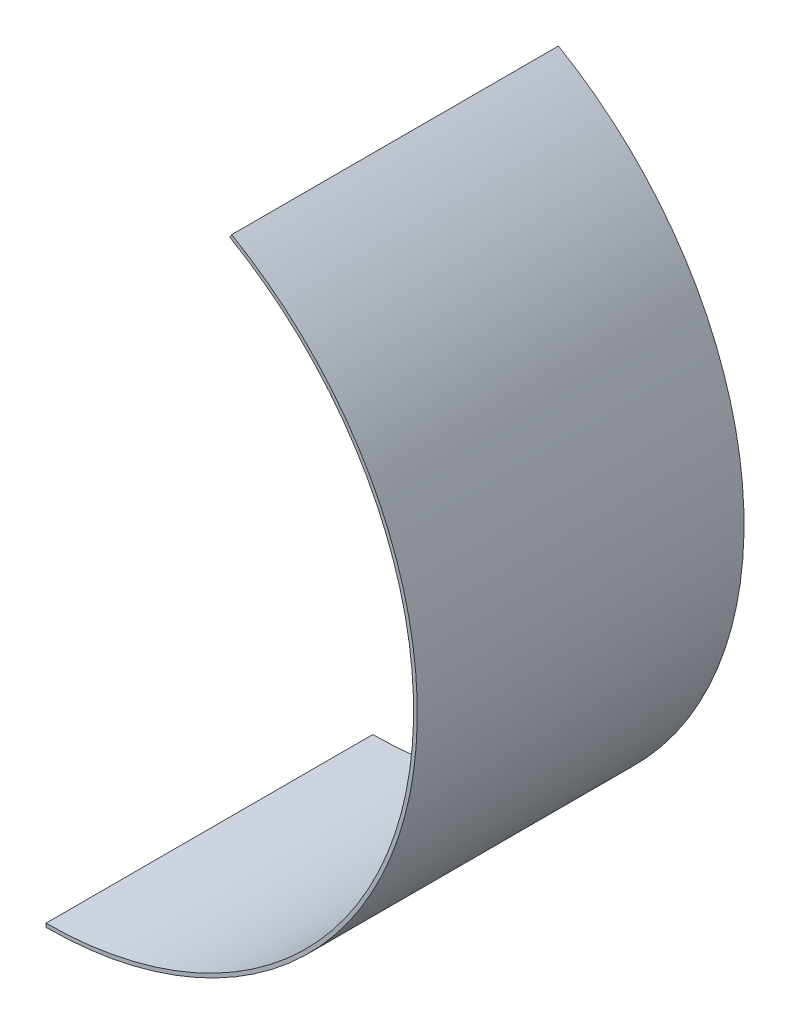
ISO-10303-21;
HEADER;
FILE_DESCRIPTION(('STEP AP214'),'2;1');
FILE_NAME('part.step','',(''),(''),'','','');
FILE_SCHEMA(('AUTOMOTIVE_DESIGN { 1 0 10303 214 1 1 1 1 }'));
ENDSEC;
DATA;
#1=APPLICATION_CONTEXT('core data for automotive mechanical design processes');
#2=APPLICATION_PROTOCOL_DEFINITION('international standard','automotive_design',2000,#1);
#3=PRODUCT_CONTEXT('',#1,'mechanical');
#4=PRODUCT('Part','Part','',(#3));
#5=PRODUCT_RELATED_PRODUCT_CATEGORY('part','',(#4));
#6=PRODUCT_DEFINITION_FORMATION('','',#4);
#7=PRODUCT_DEFINITION_CONTEXT('part definition',#1,'design');
#8=PRODUCT_DEFINITION('design','',#6,#7);
#9=PRODUCT_DEFINITION_SHAPE('','',#8);
#10=(LENGTH_UNIT() NAMED_UNIT(*) SI_UNIT(.MILLI.,.METRE.));
#11=(NAMED_UNIT(*) PLANE_ANGLE_UNIT() SI_UNIT($,.RADIAN.));
#12=(NAMED_UNIT(*) SI_UNIT($,.STERADIAN.) SOLID_ANGLE_UNIT());
#13=UNCERTAINTY_MEASURE_WITH_UNIT(LENGTH_MEASURE(1.E-05),#10,'distance_accuracy_value','');
#14=(GEOMETRIC_REPRESENTATION_CONTEXT(3) GLOBAL_UNCERTAINTY_ASSIGNED_CONTEXT((#13)) GLOBAL_UNIT_ASSIGNED_CONTEXT((#10,
#11,#12)) REPRESENTATION_CONTEXT('',''));
#15=CARTESIAN_POINT('',(0.,0.,0.));
#16=DIRECTION('',(0.,0.,1.));
#17=DIRECTION('',(1.,0.,0.));
#18=AXIS2_PLACEMENT_3D('',#15,#16,#17);
#19=CARTESIAN_POINT('',(0.,-158.75,139.7));
#20=DIRECTION('',(-1.,0.,0.));
#21=DIRECTION('',(0.,-1.,0.));
#22=AXIS2_PLACEMENT_3D('',#19,#20,#21);
#23=PLANE('',#22);
#24=DIRECTION('',(0.,1.,0.));
#25=VECTOR('',#24,1.);
#26=CARTESIAN_POINT('',(0.,-158.75,0.));
#27=LINE('',#26,#25);
#28=CARTESIAN_POINT('',(0.,-158.75,0.));
#29=VERTEX_POINT('',#28);
#30=CARTESIAN_POINT('',(0.,-157.1625,0.));
#31=VERTEX_POINT('',#30);
#32=EDGE_CURVE('E90',#29,#31,#27,.T.);
#33=ORIENTED_EDGE('',*,*,#32,.F.);
#34=DIRECTION('',(0.,0.,-1.));
#35=VECTOR('',#34,1.);
#36=CARTESIAN_POINT('',(0.,-158.75,139.7));
#37=LINE('',#36,#35);
#38=CARTESIAN_POINT('',(0.,-158.75,139.7));
#39=VERTEX_POINT('',#38);
#40=EDGE_CURVE('E48',#39,#29,#37,.T.);
#41=ORIENTED_EDGE('',*,*,#40,.F.);
#42=DIRECTION('',(0.,1.,0.));
#43=VECTOR('',#42,1.);
#44=CARTESIAN_POINT('',(0.,-158.75,139.7));
#45=LINE('',#44,#43);
#46=CARTESIAN_POINT('',(0.,-157.1625,139.7));
#47=VERTEX_POINT('',#46);
#48=EDGE_CURVE('E88',#39,#47,#45,.T.);
#49=ORIENTED_EDGE('',*,*,#48,.T.);
#50=DIRECTION('',(0.,0.,-1.));
#51=VECTOR('',#50,1.);
#52=CARTESIAN_POINT('',(0.,-157.1625,139.7));
#53=LINE('',#52,#51);
#54=EDGE_CURVE('E11',#47,#31,#53,.T.);
#55=ORIENTED_EDGE('',*,*,#54,.T.);
#56=EDGE_LOOP('',(#33,#41,#49,#55));
#57=FACE_BOUND('',#56,.T.);
#58=ADVANCED_FACE('F40',(#57),#23,.T.);
#59=CARTESIAN_POINT('',(0.,0.,139.7));
#60=DIRECTION('',(0.,0.,-1.));
#61=DIRECTION('',(-1.,0.,0.));
#62=AXIS2_PLACEMENT_3D('',#59,#60,#61);
#63=CYLINDRICAL_SURFACE('',#62,158.75);
#64=CARTESIAN_POINT('',(0.,0.,0.));
#65=DIRECTION('',(0.,0.,1.));
#66=DIRECTION('',(1.,0.,0.));
#67=AXIS2_PLACEMENT_3D('',#64,#65,#66);
#68=CIRCLE('',#67,158.75);
#69=CARTESIAN_POINT('',(79.3749999999996,137.48153285078,0.));
#70=VERTEX_POINT('',#69);
#71=EDGE_CURVE('E103',#70,#29,#68,.F.);
#72=ORIENTED_EDGE('',*,*,#71,.F.);
#73=DIRECTION('',(0.,0.,-1.));
#74=VECTOR('',#73,1.);
#75=CARTESIAN_POINT('',(79.3749999999996,137.48153285078,139.7));
#76=LINE('',#75,#74);
#77=CARTESIAN_POINT('',(79.3749999999996,137.48153285078,139.7));
#78=VERTEX_POINT('',#77);
#79=EDGE_CURVE('E74',#78,#70,#76,.T.);
#80=ORIENTED_EDGE('',*,*,#79,.F.);
#81=CARTESIAN_POINT('',(0.,0.,139.7));
#82=DIRECTION('',(0.,0.,1.));
#83=DIRECTION('',(1.,0.,0.));
#84=AXIS2_PLACEMENT_3D('',#81,#82,#83);
#85=CIRCLE('',#84,158.75);
#86=EDGE_CURVE('E94',#78,#39,#85,.F.);
#87=ORIENTED_EDGE('',*,*,#86,.T.);
#88=ORIENTED_EDGE('',*,*,#40,.T.);
#89=EDGE_LOOP('',(#72,#80,#87,#88));
#90=FACE_BOUND('',#89,.T.);
#91=ADVANCED_FACE('F96',(#90),#63,.T.);
#92=CARTESIAN_POINT('',(78.5812499999996,136.106717522272,139.7));
#93=DIRECTION('',(-0.866025403784433,0.50000000000001,0.));
#94=DIRECTION('',(-0.50000000000001,-0.866025403784433,0.));
#95=AXIS2_PLACEMENT_3D('',#92,#93,#94);
#96=PLANE('',#95);
#97=DIRECTION('',(0.50000000000001,0.866025403784433,0.));
#98=VECTOR('',#97,1.);
#99=CARTESIAN_POINT('',(78.5812499999996,136.106717522272,0.));
#100=LINE('',#99,#98);
#101=CARTESIAN_POINT('',(78.5812499999996,136.106717522272,0.));
#102=VERTEX_POINT('',#101);
#103=EDGE_CURVE('E105',#102,#70,#100,.T.);
#104=ORIENTED_EDGE('',*,*,#103,.F.);
#105=DIRECTION('',(0.,0.,-1.));
#106=VECTOR('',#105,1.);
#107=CARTESIAN_POINT('',(78.5812499999996,136.106717522272,139.7));
#108=LINE('',#107,#106);
#109=CARTESIAN_POINT('',(78.5812499999996,136.106717522272,139.7));
#110=VERTEX_POINT('',#109);
#111=EDGE_CURVE('E77',#110,#102,#108,.T.);
#112=ORIENTED_EDGE('',*,*,#111,.F.);
#113=DIRECTION('',(0.50000000000001,0.866025403784433,0.));
#114=VECTOR('',#113,1.);
#115=CARTESIAN_POINT('',(78.5812499999996,136.106717522272,139.7));
#116=LINE('',#115,#114);
#117=EDGE_CURVE('E97',#110,#78,#116,.T.);
#118=ORIENTED_EDGE('',*,*,#117,.T.);
#119=ORIENTED_EDGE('',*,*,#79,.T.);
#120=EDGE_LOOP('',(#104,#112,#118,#119));
#121=FACE_BOUND('',#120,.T.);
#122=ADVANCED_FACE('F114',(#121),#96,.T.);
#123=CARTESIAN_POINT('',(0.,0.,139.7));
#124=DIRECTION('',(0.,0.,-1.));
#125=DIRECTION('',(-1.,0.,0.));
#126=AXIS2_PLACEMENT_3D('',#123,#124,#125);
#127=CYLINDRICAL_SURFACE('',#126,157.1625);
#128=CARTESIAN_POINT('',(0.,0.,0.));
#129=DIRECTION('',(0.,0.,-1.));
#130=DIRECTION('',(-1.,0.,0.));
#131=AXIS2_PLACEMENT_3D('',#128,#129,#130);
#132=CIRCLE('',#131,157.1625);
#133=EDGE_CURVE('E108',#102,#31,#132,.T.);
#134=ORIENTED_EDGE('',*,*,#133,.T.);
#135=ORIENTED_EDGE('',*,*,#54,.F.);
#136=CARTESIAN_POINT('',(0.,0.,139.7));
#137=DIRECTION('',(0.,0.,-1.));
#138=DIRECTION('',(-1.,0.,0.));
#139=AXIS2_PLACEMENT_3D('',#136,#137,#138);
#140=CIRCLE('',#139,157.1625);
#141=EDGE_CURVE('E56',#110,#47,#140,.T.);
#142=ORIENTED_EDGE('',*,*,#141,.F.);
#143=ORIENTED_EDGE('',*,*,#111,.T.);
#144=EDGE_LOOP('',(#134,#135,#142,#143));
#145=FACE_BOUND('',#144,.T.);
#146=ADVANCED_FACE('F111',(#145),#127,.F.);
#147=CARTESIAN_POINT('',(0.,0.,139.7));
#148=DIRECTION('',(0.,0.,-1.));
#149=DIRECTION('',(-1.,0.,0.));
#150=AXIS2_PLACEMENT_3D('',#147,#148,#149);
#151=PLANE('',#150);
#152=ORIENTED_EDGE('',*,*,#141,.T.);
#153=ORIENTED_EDGE('',*,*,#48,.F.);
#154=ORIENTED_EDGE('',*,*,#86,.F.);
#155=ORIENTED_EDGE('',*,*,#117,.F.);
#156=EDGE_LOOP('',(#152,#153,#154,#155));
#157=FACE_BOUND('',#156,.T.);
#158=ADVANCED_FACE('F93',(#157),#151,.F.);
#159=CARTESIAN_POINT('',(0.,0.,0.));
#160=DIRECTION('',(0.,0.,-1.));
#161=DIRECTION('',(-1.,0.,0.));
#162=AXIS2_PLACEMENT_3D('',#159,#160,#161);
#163=PLANE('',#162);
#164=ORIENTED_EDGE('',*,*,#32,.T.);
#165=ORIENTED_EDGE('',*,*,#133,.F.);
#166=ORIENTED_EDGE('',*,*,#103,.T.);
#167=ORIENTED_EDGE('',*,*,#71,.T.);
#168=EDGE_LOOP('',(#164,#165,#166,#167));
#169=FACE_BOUND('',#168,.T.);
#170=ADVANCED_FACE('F113',(#169),#163,.T.);
#171=CLOSED_SHELL('',(#58,#91,#122,#146,#158,#170));
#172=MANIFOLD_SOLID_BREP('B2',#171);
#173=ADVANCED_BREP_SHAPE_REPRESENTATION('',(#18,#172),#14);
#174=SHAPE_DEFINITION_REPRESENTATION(#9,#173);
ENDSEC;
END-ISO-10303-21;
